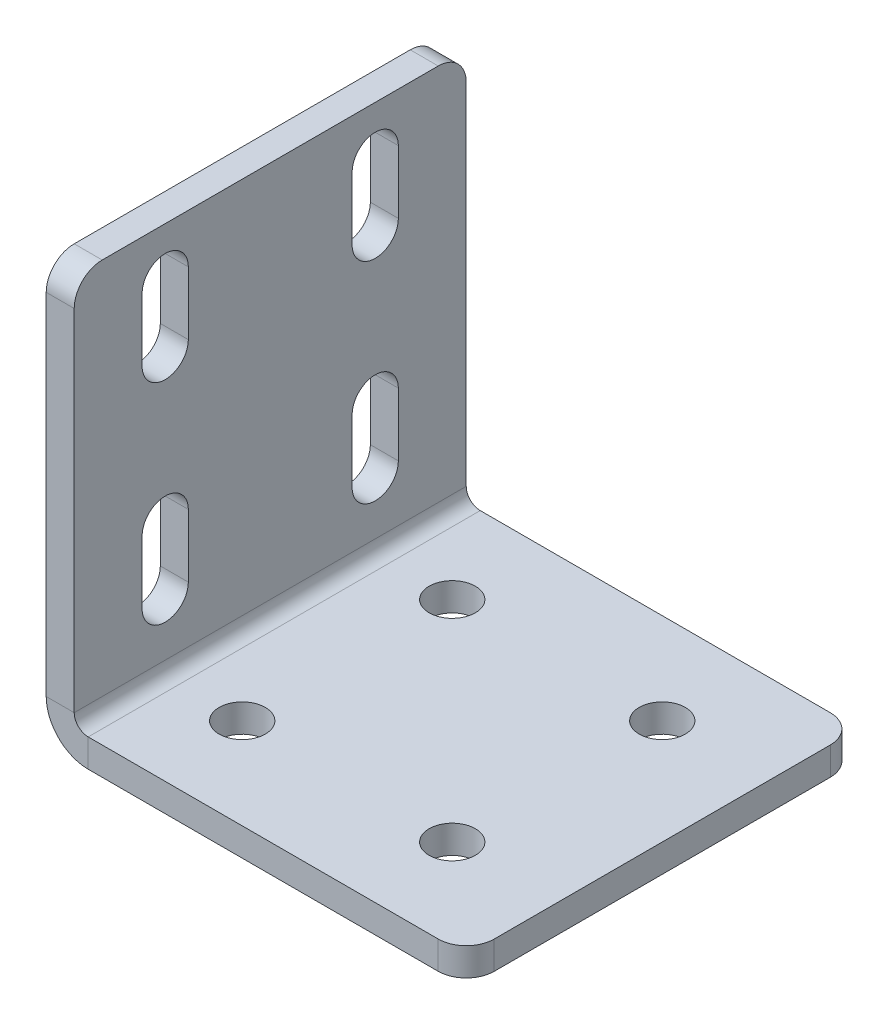
ISO-10303-21;
HEADER;
FILE_DESCRIPTION(('STEP AP214'),'2;1');
FILE_NAME('part.step','',(''),(''),'','','');
FILE_SCHEMA(('AUTOMOTIVE_DESIGN { 1 0 10303 214 1 1 1 1 }'));
ENDSEC;
DATA;
#1=APPLICATION_CONTEXT('core data for automotive mechanical design processes');
#2=APPLICATION_PROTOCOL_DEFINITION('international standard','automotive_design',2000,#1);
#3=PRODUCT_CONTEXT('',#1,'mechanical');
#4=PRODUCT('Part','Part','',(#3));
#5=PRODUCT_RELATED_PRODUCT_CATEGORY('part','',(#4));
#6=PRODUCT_DEFINITION_FORMATION('','',#4);
#7=PRODUCT_DEFINITION_CONTEXT('part definition',#1,'design');
#8=PRODUCT_DEFINITION('design','',#6,#7);
#9=PRODUCT_DEFINITION_SHAPE('','',#8);
#10=(LENGTH_UNIT() NAMED_UNIT(*) SI_UNIT(.MILLI.,.METRE.));
#11=(NAMED_UNIT(*) PLANE_ANGLE_UNIT() SI_UNIT($,.RADIAN.));
#12=(NAMED_UNIT(*) SI_UNIT($,.STERADIAN.) SOLID_ANGLE_UNIT());
#13=UNCERTAINTY_MEASURE_WITH_UNIT(LENGTH_MEASURE(1.E-05),#10,'distance_accuracy_value','');
#14=(GEOMETRIC_REPRESENTATION_CONTEXT(3) GLOBAL_UNCERTAINTY_ASSIGNED_CONTEXT((#13)) GLOBAL_UNIT_ASSIGNED_CONTEXT((#10,
#11,#12)) REPRESENTATION_CONTEXT('',''));
#15=CARTESIAN_POINT('',(0.,0.,0.));
#16=DIRECTION('',(0.,0.,1.));
#17=DIRECTION('',(1.,0.,0.));
#18=AXIS2_PLACEMENT_3D('',#15,#16,#17);
#19=CARTESIAN_POINT('',(0.,44.,-15.));
#20=DIRECTION('',(-1.,0.,0.));
#21=DIRECTION('',(0.,0.,1.));
#22=AXIS2_PLACEMENT_3D('',#19,#20,#21);
#23=CYLINDRICAL_SURFACE('',#22,3.3);
#24=CARTESIAN_POINT('',(4.,44.,-15.));
#25=DIRECTION('',(1.,0.,0.));
#26=DIRECTION('',(0.,0.,-1.));
#27=AXIS2_PLACEMENT_3D('',#24,#25,#26);
#28=CIRCLE('',#27,3.3);
#29=CARTESIAN_POINT('',(4.,44.,-11.7));
#30=VERTEX_POINT('',#29);
#31=CARTESIAN_POINT('',(4.,44.,-18.3));
#32=VERTEX_POINT('',#31);
#33=EDGE_CURVE('E497',#30,#32,#28,.T.);
#34=ORIENTED_EDGE('',*,*,#33,.T.);
#35=DIRECTION('',(1.,0.,0.));
#36=VECTOR('',#35,1.);
#37=CARTESIAN_POINT('',(0.,44.,-18.3));
#38=LINE('',#37,#36);
#39=CARTESIAN_POINT('',(0.,44.,-18.3));
#40=VERTEX_POINT('',#39);
#41=EDGE_CURVE('E308',#40,#32,#38,.T.);
#42=ORIENTED_EDGE('',*,*,#41,.F.);
#43=CARTESIAN_POINT('',(0.,44.,-15.));
#44=DIRECTION('',(1.,0.,0.));
#45=DIRECTION('',(0.,0.,-1.));
#46=AXIS2_PLACEMENT_3D('',#43,#44,#45);
#47=CIRCLE('',#46,3.3);
#48=CARTESIAN_POINT('',(0.,44.,-11.7));
#49=VERTEX_POINT('',#48);
#50=EDGE_CURVE('E386',#49,#40,#47,.T.);
#51=ORIENTED_EDGE('',*,*,#50,.F.);
#52=DIRECTION('',(1.,0.,0.));
#53=VECTOR('',#52,1.);
#54=CARTESIAN_POINT('',(0.,44.,-11.7));
#55=LINE('',#54,#53);
#56=EDGE_CURVE('E311',#49,#30,#55,.T.);
#57=ORIENTED_EDGE('',*,*,#56,.T.);
#58=EDGE_LOOP('',(#34,#42,#51,#57));
#59=FACE_BOUND('',#58,.T.);
#60=ADVANCED_FACE('F46',(#59),#23,.F.);
#61=CARTESIAN_POINT('',(0.,14.,15.));
#62=DIRECTION('',(-1.,0.,0.));
#63=DIRECTION('',(0.,0.,1.));
#64=AXIS2_PLACEMENT_3D('',#61,#62,#63);
#65=CYLINDRICAL_SURFACE('',#64,3.3);
#66=CARTESIAN_POINT('',(4.,14.,15.));
#67=DIRECTION('',(1.,0.,0.));
#68=DIRECTION('',(0.,0.,-1.));
#69=AXIS2_PLACEMENT_3D('',#66,#67,#68);
#70=CIRCLE('',#69,3.3);
#71=CARTESIAN_POINT('',(4.,14.,18.3));
#72=VERTEX_POINT('',#71);
#73=CARTESIAN_POINT('',(4.,14.,11.7));
#74=VERTEX_POINT('',#73);
#75=EDGE_CURVE('E514',#72,#74,#70,.T.);
#76=ORIENTED_EDGE('',*,*,#75,.T.);
#77=DIRECTION('',(1.,0.,0.));
#78=VECTOR('',#77,1.);
#79=CARTESIAN_POINT('',(0.,14.,11.7));
#80=LINE('',#79,#78);
#81=CARTESIAN_POINT('',(0.,14.,11.7));
#82=VERTEX_POINT('',#81);
#83=EDGE_CURVE('E376',#82,#74,#80,.T.);
#84=ORIENTED_EDGE('',*,*,#83,.F.);
#85=CARTESIAN_POINT('',(0.,14.,15.));
#86=DIRECTION('',(1.,0.,0.));
#87=DIRECTION('',(0.,0.,-1.));
#88=AXIS2_PLACEMENT_3D('',#85,#86,#87);
#89=CIRCLE('',#88,3.3);
#90=CARTESIAN_POINT('',(0.,14.,18.3));
#91=VERTEX_POINT('',#90);
#92=EDGE_CURVE('E390',#91,#82,#89,.T.);
#93=ORIENTED_EDGE('',*,*,#92,.F.);
#94=DIRECTION('',(1.,0.,0.));
#95=VECTOR('',#94,1.);
#96=CARTESIAN_POINT('',(0.,14.,18.3));
#97=LINE('',#96,#95);
#98=EDGE_CURVE('E379',#91,#72,#97,.T.);
#99=ORIENTED_EDGE('',*,*,#98,.T.);
#100=EDGE_LOOP('',(#76,#84,#93,#99));
#101=FACE_BOUND('',#100,.T.);
#102=ADVANCED_FACE('F661',(#101),#65,.F.);
#103=CARTESIAN_POINT('',(0.,44.,15.));
#104=DIRECTION('',(-1.,0.,0.));
#105=DIRECTION('',(0.,0.,1.));
#106=AXIS2_PLACEMENT_3D('',#103,#104,#105);
#107=CYLINDRICAL_SURFACE('',#106,3.3);
#108=CARTESIAN_POINT('',(4.,44.,15.));
#109=DIRECTION('',(1.,0.,0.));
#110=DIRECTION('',(0.,0.,-1.));
#111=AXIS2_PLACEMENT_3D('',#108,#109,#110);
#112=CIRCLE('',#111,3.3);
#113=CARTESIAN_POINT('',(4.,44.,18.3));
#114=VERTEX_POINT('',#113);
#115=CARTESIAN_POINT('',(4.,44.,11.7));
#116=VERTEX_POINT('',#115);
#117=EDGE_CURVE('E518',#114,#116,#112,.T.);
#118=ORIENTED_EDGE('',*,*,#117,.T.);
#119=DIRECTION('',(1.,0.,0.));
#120=VECTOR('',#119,1.);
#121=CARTESIAN_POINT('',(0.,44.,11.7));
#122=LINE('',#121,#120);
#123=CARTESIAN_POINT('',(0.,44.,11.7));
#124=VERTEX_POINT('',#123);
#125=EDGE_CURVE('E278',#124,#116,#122,.T.);
#126=ORIENTED_EDGE('',*,*,#125,.F.);
#127=CARTESIAN_POINT('',(0.,44.,15.));
#128=DIRECTION('',(1.,0.,0.));
#129=DIRECTION('',(0.,0.,-1.));
#130=AXIS2_PLACEMENT_3D('',#127,#128,#129);
#131=CIRCLE('',#130,3.3);
#132=CARTESIAN_POINT('',(0.,44.,18.3));
#133=VERTEX_POINT('',#132);
#134=EDGE_CURVE('E395',#133,#124,#131,.T.);
#135=ORIENTED_EDGE('',*,*,#134,.F.);
#136=DIRECTION('',(1.,0.,0.));
#137=VECTOR('',#136,1.);
#138=CARTESIAN_POINT('',(0.,44.,18.3));
#139=LINE('',#138,#137);
#140=EDGE_CURVE('E243',#133,#114,#139,.T.);
#141=ORIENTED_EDGE('',*,*,#140,.T.);
#142=EDGE_LOOP('',(#118,#126,#135,#141));
#143=FACE_BOUND('',#142,.T.);
#144=ADVANCED_FACE('F667',(#143),#107,.F.);
#145=CARTESIAN_POINT('',(0.,14.,-15.));
#146=DIRECTION('',(-1.,0.,0.));
#147=DIRECTION('',(0.,0.,1.));
#148=AXIS2_PLACEMENT_3D('',#145,#146,#147);
#149=CYLINDRICAL_SURFACE('',#148,3.3);
#150=CARTESIAN_POINT('',(4.,14.,-15.));
#151=DIRECTION('',(1.,0.,0.));
#152=DIRECTION('',(0.,0.,-1.));
#153=AXIS2_PLACEMENT_3D('',#150,#151,#152);
#154=CIRCLE('',#153,3.3);
#155=CARTESIAN_POINT('',(4.,14.,-11.7));
#156=VERTEX_POINT('',#155);
#157=CARTESIAN_POINT('',(4.,14.,-18.3));
#158=VERTEX_POINT('',#157);
#159=EDGE_CURVE('E507',#156,#158,#154,.T.);
#160=ORIENTED_EDGE('',*,*,#159,.T.);
#161=DIRECTION('',(1.,0.,0.));
#162=VECTOR('',#161,1.);
#163=CARTESIAN_POINT('',(0.,14.,-18.3));
#164=LINE('',#163,#162);
#165=CARTESIAN_POINT('',(0.,14.,-18.3));
#166=VERTEX_POINT('',#165);
#167=EDGE_CURVE('E341',#166,#158,#164,.T.);
#168=ORIENTED_EDGE('',*,*,#167,.F.);
#169=CARTESIAN_POINT('',(0.,14.,-15.));
#170=DIRECTION('',(1.,0.,0.));
#171=DIRECTION('',(0.,0.,-1.));
#172=AXIS2_PLACEMENT_3D('',#169,#170,#171);
#173=CIRCLE('',#172,3.3);
#174=CARTESIAN_POINT('',(0.,14.,-11.7));
#175=VERTEX_POINT('',#174);
#176=EDGE_CURVE('E398',#175,#166,#173,.T.);
#177=ORIENTED_EDGE('',*,*,#176,.F.);
#178=DIRECTION('',(1.,0.,0.));
#179=VECTOR('',#178,1.);
#180=CARTESIAN_POINT('',(0.,14.,-11.7));
#181=LINE('',#180,#179);
#182=EDGE_CURVE('E344',#175,#156,#181,.T.);
#183=ORIENTED_EDGE('',*,*,#182,.T.);
#184=EDGE_LOOP('',(#160,#168,#177,#183));
#185=FACE_BOUND('',#184,.T.);
#186=ADVANCED_FACE('F675',(#185),#149,.F.);
#187=CARTESIAN_POINT('',(0.,0.,28.));
#188=DIRECTION('',(0.,0.,-1.));
#189=DIRECTION('',(0.,-1.,0.));
#190=AXIS2_PLACEMENT_3D('',#187,#188,#189);
#191=PLANE('',#190);
#192=DIRECTION('',(0.,1.,0.));
#193=VECTOR('',#192,1.);
#194=CARTESIAN_POINT('',(4.,0.,28.));
#195=LINE('',#194,#193);
#196=CARTESIAN_POINT('',(4.,56.,28.));
#197=VERTEX_POINT('',#196);
#198=CARTESIAN_POINT('',(4.,6.,28.));
#199=VERTEX_POINT('',#198);
#200=EDGE_CURVE('E504',#197,#199,#195,.F.);
#201=ORIENTED_EDGE('',*,*,#200,.F.);
#202=DIRECTION('',(1.,0.,0.));
#203=VECTOR('',#202,1.);
#204=CARTESIAN_POINT('',(0.,56.,28.));
#205=LINE('',#204,#203);
#206=CARTESIAN_POINT('',(0.,56.,28.));
#207=VERTEX_POINT('',#206);
#208=EDGE_CURVE('E11',#197,#207,#205,.F.);
#209=ORIENTED_EDGE('',*,*,#208,.T.);
#210=DIRECTION('',(0.,-1.,0.));
#211=VECTOR('',#210,1.);
#212=CARTESIAN_POINT('',(0.,0.,28.));
#213=LINE('',#212,#211);
#214=CARTESIAN_POINT('',(0.,6.,28.));
#215=VERTEX_POINT('',#214);
#216=EDGE_CURVE('E402',#207,#215,#213,.T.);
#217=ORIENTED_EDGE('',*,*,#216,.T.);
#218=DIRECTION('',(-1.,0.,0.));
#219=VECTOR('',#218,1.);
#220=CARTESIAN_POINT('',(0.,6.,28.));
#221=LINE('',#220,#219);
#222=EDGE_CURVE('E532',#199,#215,#221,.T.);
#223=ORIENTED_EDGE('',*,*,#222,.F.);
#224=EDGE_LOOP('',(#201,#209,#217,#223));
#225=FACE_BOUND('',#224,.T.);
#226=ADVANCED_FACE('F618',(#225),#191,.F.);
#227=CARTESIAN_POINT('',(0.,60.,-28.));
#228=DIRECTION('',(0.,-1.,0.));
#229=DIRECTION('',(0.,0.,1.));
#230=AXIS2_PLACEMENT_3D('',#227,#228,#229);
#231=PLANE('',#230);
#232=DIRECTION('',(0.,0.,1.));
#233=VECTOR('',#232,1.);
#234=CARTESIAN_POINT('',(4.,60.,-28.));
#235=LINE('',#234,#233);
#236=CARTESIAN_POINT('',(4.,60.,-24.));
#237=VERTEX_POINT('',#236);
#238=CARTESIAN_POINT('',(4.,60.,24.));
#239=VERTEX_POINT('',#238);
#240=EDGE_CURVE('E500',#237,#239,#235,.T.);
#241=ORIENTED_EDGE('',*,*,#240,.F.);
#242=DIRECTION('',(-1.,0.,0.));
#243=VECTOR('',#242,1.);
#244=CARTESIAN_POINT('',(0.,60.,-24.));
#245=LINE('',#244,#243);
#246=CARTESIAN_POINT('',(0.,60.,-24.));
#247=VERTEX_POINT('',#246);
#248=EDGE_CURVE('E567',#237,#247,#245,.T.);
#249=ORIENTED_EDGE('',*,*,#248,.T.);
#250=DIRECTION('',(0.,0.,1.));
#251=VECTOR('',#250,1.);
#252=CARTESIAN_POINT('',(0.,60.,-28.));
#253=LINE('',#252,#251);
#254=CARTESIAN_POINT('',(0.,60.,24.));
#255=VERTEX_POINT('',#254);
#256=EDGE_CURVE('E405',#247,#255,#253,.T.);
#257=ORIENTED_EDGE('',*,*,#256,.T.);
#258=DIRECTION('',(1.,0.,0.));
#259=VECTOR('',#258,1.);
#260=CARTESIAN_POINT('',(0.,60.,24.));
#261=LINE('',#260,#259);
#262=EDGE_CURVE('E564',#255,#239,#261,.T.);
#263=ORIENTED_EDGE('',*,*,#262,.T.);
#264=EDGE_LOOP('',(#241,#249,#257,#263));
#265=FACE_BOUND('',#264,.T.);
#266=ADVANCED_FACE('F596',(#265),#231,.F.);
#267=CARTESIAN_POINT('',(0.,0.,-28.));
#268=DIRECTION('',(0.,0.,-1.));
#269=DIRECTION('',(0.,-1.,0.));
#270=AXIS2_PLACEMENT_3D('',#267,#268,#269);
#271=PLANE('',#270);
#272=DIRECTION('',(0.,-1.,0.));
#273=VECTOR('',#272,1.);
#274=CARTESIAN_POINT('',(0.,0.,-28.));
#275=LINE('',#274,#273);
#276=CARTESIAN_POINT('',(0.,56.,-28.));
#277=VERTEX_POINT('',#276);
#278=CARTESIAN_POINT('',(0.,6.,-28.));
#279=VERTEX_POINT('',#278);
#280=EDGE_CURVE('E409',#277,#279,#275,.T.);
#281=ORIENTED_EDGE('',*,*,#280,.F.);
#282=DIRECTION('',(1.,0.,0.));
#283=VECTOR('',#282,1.);
#284=CARTESIAN_POINT('',(0.,56.,-28.));
#285=LINE('',#284,#283);
#286=CARTESIAN_POINT('',(4.,56.,-28.));
#287=VERTEX_POINT('',#286);
#288=EDGE_CURVE('E577',#277,#287,#285,.T.);
#289=ORIENTED_EDGE('',*,*,#288,.T.);
#290=DIRECTION('',(0.,1.,0.));
#291=VECTOR('',#290,1.);
#292=CARTESIAN_POINT('',(4.,0.,-28.));
#293=LINE('',#292,#291);
#294=CARTESIAN_POINT('',(4.,6.,-28.));
#295=VERTEX_POINT('',#294);
#296=EDGE_CURVE('E470',#287,#295,#293,.F.);
#297=ORIENTED_EDGE('',*,*,#296,.T.);
#298=DIRECTION('',(-1.,0.,0.));
#299=VECTOR('',#298,1.);
#300=CARTESIAN_POINT('',(0.,6.,-28.));
#301=LINE('',#300,#299);
#302=EDGE_CURVE('E528',#295,#279,#301,.T.);
#303=ORIENTED_EDGE('',*,*,#302,.T.);
#304=EDGE_LOOP('',(#281,#289,#297,#303));
#305=FACE_BOUND('',#304,.T.);
#306=ADVANCED_FACE('F603',(#305),#271,.T.);
#307=CARTESIAN_POINT('',(6.,6.,-28.));
#308=DIRECTION('',(0.,0.,1.));
#309=DIRECTION('',(1.,0.,0.));
#310=AXIS2_PLACEMENT_3D('',#307,#308,#309);
#311=PLANE('',#310);
#312=ORIENTED_EDGE('',*,*,#302,.F.);
#313=CARTESIAN_POINT('',(6.,6.,-28.));
#314=DIRECTION('',(0.,0.,1.));
#315=DIRECTION('',(1.,0.,0.));
#316=AXIS2_PLACEMENT_3D('',#313,#314,#315);
#317=CIRCLE('',#316,2.);
#318=CARTESIAN_POINT('',(6.,4.,-28.));
#319=VERTEX_POINT('',#318);
#320=EDGE_CURVE('E493',#295,#319,#317,.T.);
#321=ORIENTED_EDGE('',*,*,#320,.T.);
#322=DIRECTION('',(0.,-1.,0.));
#323=VECTOR('',#322,1.);
#324=CARTESIAN_POINT('',(6.,0.,-28.));
#325=LINE('',#324,#323);
#326=CARTESIAN_POINT('',(6.,0.,-28.));
#327=VERTEX_POINT('',#326);
#328=EDGE_CURVE('E525',#319,#327,#325,.T.);
#329=ORIENTED_EDGE('',*,*,#328,.T.);
#330=CARTESIAN_POINT('',(6.,6.,-28.));
#331=DIRECTION('',(0.,0.,-1.));
#332=DIRECTION('',(-1.,0.,0.));
#333=AXIS2_PLACEMENT_3D('',#330,#331,#332);
#334=CIRCLE('',#333,6.);
#335=EDGE_CURVE('E391',#279,#327,#334,.F.);
#336=ORIENTED_EDGE('',*,*,#335,.F.);
#337=EDGE_LOOP('',(#312,#321,#329,#336));
#338=FACE_BOUND('',#337,.T.);
#339=ADVANCED_FACE('F608',(#338),#311,.F.);
#340=CARTESIAN_POINT('',(60.,0.,-28.));
#341=DIRECTION('',(0.,0.,-1.));
#342=DIRECTION('',(1.,0.,0.));
#343=AXIS2_PLACEMENT_3D('',#340,#341,#342);
#344=PLANE('',#343);
#345=DIRECTION('',(1.,0.,0.));
#346=VECTOR('',#345,1.);
#347=CARTESIAN_POINT('',(60.,4.,-28.));
#348=LINE('',#347,#346);
#349=CARTESIAN_POINT('',(56.,4.,-28.));
#350=VERTEX_POINT('',#349);
#351=EDGE_CURVE('E464',#319,#350,#348,.T.);
#352=ORIENTED_EDGE('',*,*,#351,.T.);
#353=DIRECTION('',(0.,-1.,0.));
#354=VECTOR('',#353,1.);
#355=CARTESIAN_POINT('',(56.,0.,-28.));
#356=LINE('',#355,#354);
#357=CARTESIAN_POINT('',(56.,0.,-28.));
#358=VERTEX_POINT('',#357);
#359=EDGE_CURVE('E536',#350,#358,#356,.T.);
#360=ORIENTED_EDGE('',*,*,#359,.T.);
#361=DIRECTION('',(1.,0.,0.));
#362=VECTOR('',#361,1.);
#363=CARTESIAN_POINT('',(60.,0.,-28.));
#364=LINE('',#363,#362);
#365=EDGE_CURVE('E436',#327,#358,#364,.T.);
#366=ORIENTED_EDGE('',*,*,#365,.F.);
#367=ORIENTED_EDGE('',*,*,#328,.F.);
#368=EDGE_LOOP('',(#352,#360,#366,#367));
#369=FACE_BOUND('',#368,.T.);
#370=ADVANCED_FACE('F651',(#369),#344,.T.);
#371=CARTESIAN_POINT('',(60.,0.,-28.));
#372=DIRECTION('',(1.,0.,0.));
#373=DIRECTION('',(0.,0.,1.));
#374=AXIS2_PLACEMENT_3D('',#371,#372,#373);
#375=PLANE('',#374);
#376=DIRECTION('',(0.,0.,1.));
#377=VECTOR('',#376,1.);
#378=CARTESIAN_POINT('',(60.,0.,-28.));
#379=LINE('',#378,#377);
#380=CARTESIAN_POINT('',(60.,0.,-24.));
#381=VERTEX_POINT('',#380);
#382=CARTESIAN_POINT('',(60.,0.,24.));
#383=VERTEX_POINT('',#382);
#384=EDGE_CURVE('E428',#381,#383,#379,.T.);
#385=ORIENTED_EDGE('',*,*,#384,.F.);
#386=DIRECTION('',(0.,-1.,0.));
#387=VECTOR('',#386,1.);
#388=CARTESIAN_POINT('',(60.,0.,-24.));
#389=LINE('',#388,#387);
#390=CARTESIAN_POINT('',(60.,4.,-24.));
#391=VERTEX_POINT('',#390);
#392=EDGE_CURVE('E552',#381,#391,#389,.F.);
#393=ORIENTED_EDGE('',*,*,#392,.T.);
#394=DIRECTION('',(0.,0.,1.));
#395=VECTOR('',#394,1.);
#396=CARTESIAN_POINT('',(60.,4.,-28.));
#397=LINE('',#396,#395);
#398=CARTESIAN_POINT('',(60.,4.,24.));
#399=VERTEX_POINT('',#398);
#400=EDGE_CURVE('E482',#391,#399,#397,.T.);
#401=ORIENTED_EDGE('',*,*,#400,.T.);
#402=DIRECTION('',(0.,1.,0.));
#403=VECTOR('',#402,1.);
#404=CARTESIAN_POINT('',(60.,0.,24.));
#405=LINE('',#404,#403);
#406=EDGE_CURVE('E548',#399,#383,#405,.F.);
#407=ORIENTED_EDGE('',*,*,#406,.T.);
#408=EDGE_LOOP('',(#385,#393,#401,#407));
#409=FACE_BOUND('',#408,.T.);
#410=ADVANCED_FACE('F642',(#409),#375,.T.);
#411=CARTESIAN_POINT('',(60.,0.,28.));
#412=DIRECTION('',(0.,0.,-1.));
#413=DIRECTION('',(1.,0.,0.));
#414=AXIS2_PLACEMENT_3D('',#411,#412,#413);
#415=PLANE('',#414);
#416=DIRECTION('',(1.,0.,0.));
#417=VECTOR('',#416,1.);
#418=CARTESIAN_POINT('',(60.,0.,28.));
#419=LINE('',#418,#417);
#420=CARTESIAN_POINT('',(6.,0.,28.));
#421=VERTEX_POINT('',#420);
#422=CARTESIAN_POINT('',(56.,0.,28.));
#423=VERTEX_POINT('',#422);
#424=EDGE_CURVE('E432',#421,#423,#419,.T.);
#425=ORIENTED_EDGE('',*,*,#424,.T.);
#426=DIRECTION('',(0.,-1.,0.));
#427=VECTOR('',#426,1.);
#428=CARTESIAN_POINT('',(56.,0.,28.));
#429=LINE('',#428,#427);
#430=CARTESIAN_POINT('',(56.,4.,28.));
#431=VERTEX_POINT('',#430);
#432=EDGE_CURVE('E561',#423,#431,#429,.F.);
#433=ORIENTED_EDGE('',*,*,#432,.T.);
#434=DIRECTION('',(1.,0.,0.));
#435=VECTOR('',#434,1.);
#436=CARTESIAN_POINT('',(60.,4.,28.));
#437=LINE('',#436,#435);
#438=CARTESIAN_POINT('',(6.,4.,28.));
#439=VERTEX_POINT('',#438);
#440=EDGE_CURVE('E483',#439,#431,#437,.T.);
#441=ORIENTED_EDGE('',*,*,#440,.F.);
#442=DIRECTION('',(0.,-1.,0.));
#443=VECTOR('',#442,1.);
#444=CARTESIAN_POINT('',(6.,0.,28.));
#445=LINE('',#444,#443);
#446=EDGE_CURVE('E448',#439,#421,#445,.T.);
#447=ORIENTED_EDGE('',*,*,#446,.T.);
#448=EDGE_LOOP('',(#425,#433,#441,#447));
#449=FACE_BOUND('',#448,.T.);
#450=ADVANCED_FACE('F629',(#449),#415,.F.);
#451=CARTESIAN_POINT('',(15.,0.,-15.));
#452=DIRECTION('',(0.,-1.,0.));
#453=DIRECTION('',(1.,0.,0.));
#454=AXIS2_PLACEMENT_3D('',#451,#452,#453);
#455=CYLINDRICAL_SURFACE('',#454,3.29999999999999);
#456=CARTESIAN_POINT('',(15.,0.,-15.));
#457=DIRECTION('',(0.,-1.,0.));
#458=DIRECTION('',(0.,0.,-1.));
#459=AXIS2_PLACEMENT_3D('',#456,#457,#458);
#460=CIRCLE('',#459,3.29999999999999);
#461=CARTESIAN_POINT('',(15.,0.,-18.3));
#462=VERTEX_POINT('',#461);
#463=EDGE_CURVE('E412',#462,#462,#460,.T.);
#464=ORIENTED_EDGE('',*,*,#463,.T.);
#465=EDGE_LOOP('',(#464));
#466=FACE_BOUND('',#465,.T.);
#467=CARTESIAN_POINT('',(15.,4.,-15.));
#468=DIRECTION('',(0.,-1.,0.));
#469=DIRECTION('',(0.,0.,-1.));
#470=AXIS2_PLACEMENT_3D('',#467,#468,#469);
#471=CIRCLE('',#470,3.29999999999999);
#472=CARTESIAN_POINT('',(15.,4.,-18.3));
#473=VERTEX_POINT('',#472);
#474=EDGE_CURVE('E465',#473,#473,#471,.T.);
#475=ORIENTED_EDGE('',*,*,#474,.F.);
#476=EDGE_LOOP('',(#475));
#477=FACE_BOUND('',#476,.T.);
#478=ADVANCED_FACE('F719',(#466,#477),#455,.F.);
#479=CARTESIAN_POINT('',(45.,0.,15.));
#480=DIRECTION('',(0.,-1.,0.));
#481=DIRECTION('',(1.,0.,0.));
#482=AXIS2_PLACEMENT_3D('',#479,#480,#481);
#483=CYLINDRICAL_SURFACE('',#482,3.29999999999999);
#484=CARTESIAN_POINT('',(45.,0.,15.));
#485=DIRECTION('',(0.,-1.,0.));
#486=DIRECTION('',(0.,0.,-1.));
#487=AXIS2_PLACEMENT_3D('',#484,#485,#486);
#488=CIRCLE('',#487,3.29999999999999);
#489=CARTESIAN_POINT('',(45.,0.,11.7));
#490=VERTEX_POINT('',#489);
#491=EDGE_CURVE('E416',#490,#490,#488,.T.);
#492=ORIENTED_EDGE('',*,*,#491,.T.);
#493=EDGE_LOOP('',(#492));
#494=FACE_BOUND('',#493,.T.);
#495=CARTESIAN_POINT('',(45.,4.,15.));
#496=DIRECTION('',(0.,-1.,0.));
#497=DIRECTION('',(0.,0.,-1.));
#498=AXIS2_PLACEMENT_3D('',#495,#496,#497);
#499=CIRCLE('',#498,3.29999999999999);
#500=CARTESIAN_POINT('',(45.,4.,11.7));
#501=VERTEX_POINT('',#500);
#502=EDGE_CURVE('E469',#501,#501,#499,.T.);
#503=ORIENTED_EDGE('',*,*,#502,.F.);
#504=EDGE_LOOP('',(#503));
#505=FACE_BOUND('',#504,.T.);
#506=ADVANCED_FACE('F722',(#494,#505),#483,.F.);
#507=CARTESIAN_POINT('',(45.,0.,-15.));
#508=DIRECTION('',(0.,-1.,0.));
#509=DIRECTION('',(1.,0.,0.));
#510=AXIS2_PLACEMENT_3D('',#507,#508,#509);
#511=CYLINDRICAL_SURFACE('',#510,3.29999999999999);
#512=CARTESIAN_POINT('',(45.,0.,-15.));
#513=DIRECTION('',(0.,-1.,0.));
#514=DIRECTION('',(0.,0.,-1.));
#515=AXIS2_PLACEMENT_3D('',#512,#513,#514);
#516=CIRCLE('',#515,3.29999999999999);
#517=CARTESIAN_POINT('',(45.,0.,-18.3));
#518=VERTEX_POINT('',#517);
#519=EDGE_CURVE('E420',#518,#518,#516,.T.);
#520=ORIENTED_EDGE('',*,*,#519,.T.);
#521=EDGE_LOOP('',(#520));
#522=FACE_BOUND('',#521,.T.);
#523=CARTESIAN_POINT('',(45.,4.,-15.));
#524=DIRECTION('',(0.,-1.,0.));
#525=DIRECTION('',(0.,0.,-1.));
#526=AXIS2_PLACEMENT_3D('',#523,#524,#525);
#527=CIRCLE('',#526,3.29999999999999);
#528=CARTESIAN_POINT('',(45.,4.,-18.3));
#529=VERTEX_POINT('',#528);
#530=EDGE_CURVE('E474',#529,#529,#527,.T.);
#531=ORIENTED_EDGE('',*,*,#530,.F.);
#532=EDGE_LOOP('',(#531));
#533=FACE_BOUND('',#532,.T.);
#534=ADVANCED_FACE('F726',(#522,#533),#511,.F.);
#535=CARTESIAN_POINT('',(15.,0.,15.));
#536=DIRECTION('',(0.,-1.,0.));
#537=DIRECTION('',(1.,0.,0.));
#538=AXIS2_PLACEMENT_3D('',#535,#536,#537);
#539=CYLINDRICAL_SURFACE('',#538,3.29999999999999);
#540=CARTESIAN_POINT('',(15.,0.,15.));
#541=DIRECTION('',(0.,-1.,0.));
#542=DIRECTION('',(0.,0.,-1.));
#543=AXIS2_PLACEMENT_3D('',#540,#541,#542);
#544=CIRCLE('',#543,3.29999999999999);
#545=CARTESIAN_POINT('',(15.,0.,11.7));
#546=VERTEX_POINT('',#545);
#547=EDGE_CURVE('E424',#546,#546,#544,.T.);
#548=ORIENTED_EDGE('',*,*,#547,.T.);
#549=EDGE_LOOP('',(#548));
#550=FACE_BOUND('',#549,.T.);
#551=CARTESIAN_POINT('',(15.,4.,15.));
#552=DIRECTION('',(0.,-1.,0.));
#553=DIRECTION('',(0.,0.,-1.));
#554=AXIS2_PLACEMENT_3D('',#551,#552,#553);
#555=CIRCLE('',#554,3.29999999999999);
#556=CARTESIAN_POINT('',(15.,4.,11.7));
#557=VERTEX_POINT('',#556);
#558=EDGE_CURVE('E478',#557,#557,#555,.T.);
#559=ORIENTED_EDGE('',*,*,#558,.F.);
#560=EDGE_LOOP('',(#559));
#561=FACE_BOUND('',#560,.T.);
#562=ADVANCED_FACE('F730',(#550,#561),#539,.F.);
#563=CARTESIAN_POINT('',(6.,6.,28.));
#564=DIRECTION('',(0.,0.,-1.));
#565=DIRECTION('',(-1.,0.,0.));
#566=AXIS2_PLACEMENT_3D('',#563,#564,#565);
#567=PLANE('',#566);
#568=CARTESIAN_POINT('',(6.,6.,28.));
#569=DIRECTION('',(0.,0.,1.));
#570=DIRECTION('',(1.,0.,0.));
#571=AXIS2_PLACEMENT_3D('',#568,#569,#570);
#572=CIRCLE('',#571,2.);
#573=EDGE_CURVE('E375',#439,#199,#572,.F.);
#574=ORIENTED_EDGE('',*,*,#573,.T.);
#575=ORIENTED_EDGE('',*,*,#222,.T.);
#576=CARTESIAN_POINT('',(6.,6.,28.));
#577=DIRECTION('',(0.,0.,1.));
#578=DIRECTION('',(1.,0.,0.));
#579=AXIS2_PLACEMENT_3D('',#576,#577,#578);
#580=CIRCLE('',#579,6.);
#581=EDGE_CURVE('E449',#421,#215,#580,.F.);
#582=ORIENTED_EDGE('',*,*,#581,.F.);
#583=ORIENTED_EDGE('',*,*,#446,.F.);
#584=EDGE_LOOP('',(#574,#575,#582,#583));
#585=FACE_BOUND('',#584,.T.);
#586=ADVANCED_FACE('F621',(#585),#567,.F.);
#587=CARTESIAN_POINT('',(60.,0.,-28.));
#588=DIRECTION('',(0.,-1.,0.));
#589=DIRECTION('',(1.,0.,0.));
#590=AXIS2_PLACEMENT_3D('',#587,#588,#589);
#591=PLANE('',#590);
#592=ORIENTED_EDGE('',*,*,#463,.F.);
#593=EDGE_LOOP('',(#592));
#594=FACE_BOUND('',#593,.T.);
#595=ORIENTED_EDGE('',*,*,#491,.F.);
#596=EDGE_LOOP('',(#595));
#597=FACE_BOUND('',#596,.T.);
#598=ORIENTED_EDGE('',*,*,#519,.F.);
#599=EDGE_LOOP('',(#598));
#600=FACE_BOUND('',#599,.T.);
#601=ORIENTED_EDGE('',*,*,#547,.F.);
#602=EDGE_LOOP('',(#601));
#603=FACE_BOUND('',#602,.T.);
#604=ORIENTED_EDGE('',*,*,#365,.T.);
#605=CARTESIAN_POINT('',(56.,0.,-24.));
#606=DIRECTION('',(0.,-1.,0.));
#607=DIRECTION('',(1.,0.,0.));
#608=AXIS2_PLACEMENT_3D('',#605,#606,#607);
#609=CIRCLE('',#608,4.);
#610=EDGE_CURVE('E545',#358,#381,#609,.T.);
#611=ORIENTED_EDGE('',*,*,#610,.T.);
#612=ORIENTED_EDGE('',*,*,#384,.T.);
#613=CARTESIAN_POINT('',(56.,0.,24.));
#614=DIRECTION('',(0.,-1.,0.));
#615=DIRECTION('',(1.,0.,0.));
#616=AXIS2_PLACEMENT_3D('',#613,#614,#615);
#617=CIRCLE('',#616,4.);
#618=EDGE_CURVE('E542',#383,#423,#617,.T.);
#619=ORIENTED_EDGE('',*,*,#618,.T.);
#620=ORIENTED_EDGE('',*,*,#424,.F.);
#621=DIRECTION('',(0.,0.,1.));
#622=VECTOR('',#621,1.);
#623=CARTESIAN_POINT('',(6.,0.,-28.));
#624=LINE('',#623,#622);
#625=EDGE_CURVE('E444',#421,#327,#624,.F.);
#626=ORIENTED_EDGE('',*,*,#625,.T.);
#627=EDGE_LOOP('',(#604,#611,#612,#619,#620,#626));
#628=FACE_BOUND('',#627,.T.);
#629=ADVANCED_FACE('F645',(#594,#597,#600,#603,#628),#591,.T.);
#630=CARTESIAN_POINT('',(0.,0.,-28.));
#631=DIRECTION('',(-1.,0.,0.));
#632=DIRECTION('',(0.,0.,1.));
#633=AXIS2_PLACEMENT_3D('',#630,#631,#632);
#634=PLANE('',#633);
#635=DIRECTION('',(0.,1.,0.));
#636=VECTOR('',#635,1.);
#637=CARTESIAN_POINT('',(0.,23.,-18.3));
#638=LINE('',#637,#636);
#639=CARTESIAN_POINT('',(0.,23.,-18.3));
#640=VERTEX_POINT('',#639);
#641=EDGE_CURVE('E326',#166,#640,#638,.T.);
#642=ORIENTED_EDGE('',*,*,#641,.T.);
#643=CARTESIAN_POINT('',(0.,23.,-15.));
#644=DIRECTION('',(1.,0.,0.));
#645=DIRECTION('',(0.,0.,-1.));
#646=AXIS2_PLACEMENT_3D('',#643,#644,#645);
#647=CIRCLE('',#646,3.3);
#648=CARTESIAN_POINT('',(0.,23.,-11.7));
#649=VERTEX_POINT('',#648);
#650=EDGE_CURVE('E317',#640,#649,#647,.T.);
#651=ORIENTED_EDGE('',*,*,#650,.T.);
#652=DIRECTION('',(0.,-1.,0.));
#653=VECTOR('',#652,1.);
#654=CARTESIAN_POINT('',(0.,23.,-11.7));
#655=LINE('',#654,#653);
#656=EDGE_CURVE('E321',#649,#175,#655,.T.);
#657=ORIENTED_EDGE('',*,*,#656,.T.);
#658=ORIENTED_EDGE('',*,*,#176,.T.);
#659=EDGE_LOOP('',(#642,#651,#657,#658));
#660=FACE_BOUND('',#659,.T.);
#661=DIRECTION('',(0.,1.,0.));
#662=VECTOR('',#661,1.);
#663=CARTESIAN_POINT('',(0.,53.,-18.3));
#664=LINE('',#663,#662);
#665=CARTESIAN_POINT('',(0.,53.,-18.3));
#666=VERTEX_POINT('',#665);
#667=EDGE_CURVE('E292',#40,#666,#664,.T.);
#668=ORIENTED_EDGE('',*,*,#667,.T.);
#669=CARTESIAN_POINT('',(0.,53.,-15.));
#670=DIRECTION('',(1.,0.,0.));
#671=DIRECTION('',(0.,0.,-1.));
#672=AXIS2_PLACEMENT_3D('',#669,#670,#671);
#673=CIRCLE('',#672,3.3);
#674=CARTESIAN_POINT('',(0.,53.,-11.7));
#675=VERTEX_POINT('',#674);
#676=EDGE_CURVE('E283',#666,#675,#673,.T.);
#677=ORIENTED_EDGE('',*,*,#676,.T.);
#678=DIRECTION('',(0.,-1.,0.));
#679=VECTOR('',#678,1.);
#680=CARTESIAN_POINT('',(0.,53.,-11.7));
#681=LINE('',#680,#679);
#682=EDGE_CURVE('E287',#675,#49,#681,.T.);
#683=ORIENTED_EDGE('',*,*,#682,.T.);
#684=ORIENTED_EDGE('',*,*,#50,.T.);
#685=EDGE_LOOP('',(#668,#677,#683,#684));
#686=FACE_BOUND('',#685,.T.);
#687=DIRECTION('',(0.,1.,0.));
#688=VECTOR('',#687,1.);
#689=CARTESIAN_POINT('',(0.,53.,11.7));
#690=LINE('',#689,#688);
#691=CARTESIAN_POINT('',(0.,53.,11.7));
#692=VERTEX_POINT('',#691);
#693=EDGE_CURVE('E244',#124,#692,#690,.T.);
#694=ORIENTED_EDGE('',*,*,#693,.T.);
#695=CARTESIAN_POINT('',(0.,53.,15.));
#696=DIRECTION('',(1.,0.,0.));
#697=DIRECTION('',(0.,0.,-1.));
#698=AXIS2_PLACEMENT_3D('',#695,#696,#697);
#699=CIRCLE('',#698,3.3);
#700=CARTESIAN_POINT('',(0.,53.,18.3));
#701=VERTEX_POINT('',#700);
#702=EDGE_CURVE('E236',#692,#701,#699,.T.);
#703=ORIENTED_EDGE('',*,*,#702,.T.);
#704=DIRECTION('',(0.,-1.,0.));
#705=VECTOR('',#704,1.);
#706=CARTESIAN_POINT('',(0.,53.,18.3));
#707=LINE('',#706,#705);
#708=EDGE_CURVE('E247',#701,#133,#707,.T.);
#709=ORIENTED_EDGE('',*,*,#708,.T.);
#710=ORIENTED_EDGE('',*,*,#134,.T.);
#711=EDGE_LOOP('',(#694,#703,#709,#710));
#712=FACE_BOUND('',#711,.T.);
#713=DIRECTION('',(0.,1.,0.));
#714=VECTOR('',#713,1.);
#715=CARTESIAN_POINT('',(0.,23.,11.7));
#716=LINE('',#715,#714);
#717=CARTESIAN_POINT('',(0.,23.,11.7));
#718=VERTEX_POINT('',#717);
#719=EDGE_CURVE('E359',#82,#718,#716,.T.);
#720=ORIENTED_EDGE('',*,*,#719,.T.);
#721=CARTESIAN_POINT('',(0.,23.,15.));
#722=DIRECTION('',(1.,0.,0.));
#723=DIRECTION('',(0.,0.,-1.));
#724=AXIS2_PLACEMENT_3D('',#721,#722,#723);
#725=CIRCLE('',#724,3.3);
#726=CARTESIAN_POINT('',(0.,23.,18.3));
#727=VERTEX_POINT('',#726);
#728=EDGE_CURVE('E350',#718,#727,#725,.T.);
#729=ORIENTED_EDGE('',*,*,#728,.T.);
#730=DIRECTION('',(0.,-1.,0.));
#731=VECTOR('',#730,1.);
#732=CARTESIAN_POINT('',(0.,23.,18.3));
#733=LINE('',#732,#731);
#734=EDGE_CURVE('E354',#727,#91,#733,.T.);
#735=ORIENTED_EDGE('',*,*,#734,.T.);
#736=ORIENTED_EDGE('',*,*,#92,.T.);
#737=EDGE_LOOP('',(#720,#729,#735,#736));
#738=FACE_BOUND('',#737,.T.);
#739=ORIENTED_EDGE('',*,*,#256,.F.);
#740=CARTESIAN_POINT('',(0.,56.,-24.));
#741=DIRECTION('',(-1.,0.,0.));
#742=DIRECTION('',(0.,0.,1.));
#743=AXIS2_PLACEMENT_3D('',#740,#741,#742);
#744=CIRCLE('',#743,4.);
#745=EDGE_CURVE('E574',#247,#277,#744,.T.);
#746=ORIENTED_EDGE('',*,*,#745,.T.);
#747=ORIENTED_EDGE('',*,*,#280,.T.);
#748=DIRECTION('',(0.,0.,1.));
#749=VECTOR('',#748,1.);
#750=CARTESIAN_POINT('',(0.,6.,-28.));
#751=LINE('',#750,#749);
#752=EDGE_CURVE('E440',#279,#215,#751,.T.);
#753=ORIENTED_EDGE('',*,*,#752,.T.);
#754=ORIENTED_EDGE('',*,*,#216,.F.);
#755=CARTESIAN_POINT('',(0.,56.,24.));
#756=DIRECTION('',(-1.,0.,0.));
#757=DIRECTION('',(0.,0.,1.));
#758=AXIS2_PLACEMENT_3D('',#755,#756,#757);
#759=CIRCLE('',#758,4.);
#760=EDGE_CURVE('E571',#207,#255,#759,.T.);
#761=ORIENTED_EDGE('',*,*,#760,.T.);
#762=EDGE_LOOP('',(#739,#746,#747,#753,#754,#761));
#763=FACE_BOUND('',#762,.T.);
#764=ADVANCED_FACE('F255',(#660,#686,#712,#738,#763),#634,.T.);
#765=CARTESIAN_POINT('',(6.,6.,-28.));
#766=DIRECTION('',(0.,0.,1.));
#767=DIRECTION('',(1.,0.,0.));
#768=AXIS2_PLACEMENT_3D('',#765,#766,#767);
#769=CYLINDRICAL_SURFACE('',#768,6.);
#770=ORIENTED_EDGE('',*,*,#335,.T.);
#771=ORIENTED_EDGE('',*,*,#625,.F.);
#772=ORIENTED_EDGE('',*,*,#581,.T.);
#773=ORIENTED_EDGE('',*,*,#752,.F.);
#774=EDGE_LOOP('',(#770,#771,#772,#773));
#775=FACE_BOUND('',#774,.T.);
#776=ADVANCED_FACE('F612',(#775),#769,.T.);
#777=CARTESIAN_POINT('',(60.,4.,-28.));
#778=DIRECTION('',(0.,-1.,0.));
#779=DIRECTION('',(1.,0.,0.));
#780=AXIS2_PLACEMENT_3D('',#777,#778,#779);
#781=PLANE('',#780);
#782=ORIENTED_EDGE('',*,*,#474,.T.);
#783=EDGE_LOOP('',(#782));
#784=FACE_BOUND('',#783,.T.);
#785=ORIENTED_EDGE('',*,*,#502,.T.);
#786=EDGE_LOOP('',(#785));
#787=FACE_BOUND('',#786,.T.);
#788=ORIENTED_EDGE('',*,*,#530,.T.);
#789=EDGE_LOOP('',(#788));
#790=FACE_BOUND('',#789,.T.);
#791=ORIENTED_EDGE('',*,*,#558,.T.);
#792=EDGE_LOOP('',(#791));
#793=FACE_BOUND('',#792,.T.);
#794=ORIENTED_EDGE('',*,*,#400,.F.);
#795=CARTESIAN_POINT('',(56.,4.,-24.));
#796=DIRECTION('',(0.,-1.,0.));
#797=DIRECTION('',(1.,0.,0.));
#798=AXIS2_PLACEMENT_3D('',#795,#796,#797);
#799=CIRCLE('',#798,4.);
#800=EDGE_CURVE('E558',#391,#350,#799,.F.);
#801=ORIENTED_EDGE('',*,*,#800,.T.);
#802=ORIENTED_EDGE('',*,*,#351,.F.);
#803=DIRECTION('',(0.,0.,1.));
#804=VECTOR('',#803,1.);
#805=CARTESIAN_POINT('',(6.,4.,-28.));
#806=LINE('',#805,#804);
#807=EDGE_CURVE('E453',#439,#319,#806,.F.);
#808=ORIENTED_EDGE('',*,*,#807,.F.);
#809=ORIENTED_EDGE('',*,*,#440,.T.);
#810=CARTESIAN_POINT('',(56.,4.,24.));
#811=DIRECTION('',(0.,-1.,0.));
#812=DIRECTION('',(1.,0.,0.));
#813=AXIS2_PLACEMENT_3D('',#810,#811,#812);
#814=CIRCLE('',#813,4.);
#815=EDGE_CURVE('E555',#431,#399,#814,.F.);
#816=ORIENTED_EDGE('',*,*,#815,.T.);
#817=EDGE_LOOP('',(#794,#801,#802,#808,#809,#816));
#818=FACE_BOUND('',#817,.T.);
#819=ADVANCED_FACE('F635',(#784,#787,#790,#793,#818),#781,.F.);
#820=CARTESIAN_POINT('',(4.,0.,-28.));
#821=DIRECTION('',(-1.,0.,0.));
#822=DIRECTION('',(0.,0.,1.));
#823=AXIS2_PLACEMENT_3D('',#820,#821,#822);
#824=PLANE('',#823);
#825=CARTESIAN_POINT('',(4.,53.,-15.));
#826=DIRECTION('',(1.,0.,0.));
#827=DIRECTION('',(0.,0.,-1.));
#828=AXIS2_PLACEMENT_3D('',#825,#826,#827);
#829=CIRCLE('',#828,3.3);
#830=CARTESIAN_POINT('',(4.,53.,-18.3));
#831=VERTEX_POINT('',#830);
#832=CARTESIAN_POINT('',(4.,53.,-11.7));
#833=VERTEX_POINT('',#832);
#834=EDGE_CURVE('E70',#831,#833,#829,.T.);
#835=ORIENTED_EDGE('',*,*,#834,.F.);
#836=DIRECTION('',(0.,1.,0.));
#837=VECTOR('',#836,1.);
#838=CARTESIAN_POINT('',(4.,53.,-18.3));
#839=LINE('',#838,#837);
#840=EDGE_CURVE('E288',#32,#831,#839,.T.);
#841=ORIENTED_EDGE('',*,*,#840,.F.);
#842=ORIENTED_EDGE('',*,*,#33,.F.);
#843=DIRECTION('',(0.,-1.,0.));
#844=VECTOR('',#843,1.);
#845=CARTESIAN_POINT('',(4.,53.,-11.7));
#846=LINE('',#845,#844);
#847=EDGE_CURVE('E299',#833,#30,#846,.T.);
#848=ORIENTED_EDGE('',*,*,#847,.F.);
#849=EDGE_LOOP('',(#835,#841,#842,#848));
#850=FACE_BOUND('',#849,.T.);
#851=CARTESIAN_POINT('',(4.,23.,15.));
#852=DIRECTION('',(1.,0.,0.));
#853=DIRECTION('',(0.,0.,-1.));
#854=AXIS2_PLACEMENT_3D('',#851,#852,#853);
#855=CIRCLE('',#854,3.3);
#856=CARTESIAN_POINT('',(4.,23.,11.7));
#857=VERTEX_POINT('',#856);
#858=CARTESIAN_POINT('',(4.,23.,18.3));
#859=VERTEX_POINT('',#858);
#860=EDGE_CURVE('E277',#857,#859,#855,.T.);
#861=ORIENTED_EDGE('',*,*,#860,.F.);
#862=DIRECTION('',(0.,1.,0.));
#863=VECTOR('',#862,1.);
#864=CARTESIAN_POINT('',(4.,23.,11.7));
#865=LINE('',#864,#863);
#866=EDGE_CURVE('E355',#74,#857,#865,.T.);
#867=ORIENTED_EDGE('',*,*,#866,.F.);
#868=ORIENTED_EDGE('',*,*,#75,.F.);
#869=DIRECTION('',(0.,-1.,0.));
#870=VECTOR('',#869,1.);
#871=CARTESIAN_POINT('',(4.,23.,18.3));
#872=LINE('',#871,#870);
#873=EDGE_CURVE('E366',#859,#72,#872,.T.);
#874=ORIENTED_EDGE('',*,*,#873,.F.);
#875=EDGE_LOOP('',(#861,#867,#868,#874));
#876=FACE_BOUND('',#875,.T.);
#877=CARTESIAN_POINT('',(4.,53.,15.));
#878=DIRECTION('',(1.,0.,0.));
#879=DIRECTION('',(0.,0.,-1.));
#880=AXIS2_PLACEMENT_3D('',#877,#878,#879);
#881=CIRCLE('',#880,3.3);
#882=CARTESIAN_POINT('',(4.,53.,11.7));
#883=VERTEX_POINT('',#882);
#884=CARTESIAN_POINT('',(4.,53.,18.3));
#885=VERTEX_POINT('',#884);
#886=EDGE_CURVE('E239',#883,#885,#881,.T.);
#887=ORIENTED_EDGE('',*,*,#886,.F.);
#888=DIRECTION('',(0.,1.,0.));
#889=VECTOR('',#888,1.);
#890=CARTESIAN_POINT('',(4.,53.,11.7));
#891=LINE('',#890,#889);
#892=EDGE_CURVE('E258',#116,#883,#891,.T.);
#893=ORIENTED_EDGE('',*,*,#892,.F.);
#894=ORIENTED_EDGE('',*,*,#117,.F.);
#895=DIRECTION('',(0.,-1.,0.));
#896=VECTOR('',#895,1.);
#897=CARTESIAN_POINT('',(4.,53.,18.3));
#898=LINE('',#897,#896);
#899=EDGE_CURVE('E264',#885,#114,#898,.T.);
#900=ORIENTED_EDGE('',*,*,#899,.F.);
#901=EDGE_LOOP('',(#887,#893,#894,#900));
#902=FACE_BOUND('',#901,.T.);
#903=CARTESIAN_POINT('',(4.,23.,-15.));
#904=DIRECTION('',(1.,0.,0.));
#905=DIRECTION('',(0.,0.,-1.));
#906=AXIS2_PLACEMENT_3D('',#903,#904,#905);
#907=CIRCLE('',#906,3.3);
#908=CARTESIAN_POINT('',(4.,23.,-18.3));
#909=VERTEX_POINT('',#908);
#910=CARTESIAN_POINT('',(4.,23.,-11.7));
#911=VERTEX_POINT('',#910);
#912=EDGE_CURVE('E62',#909,#911,#907,.T.);
#913=ORIENTED_EDGE('',*,*,#912,.F.);
#914=DIRECTION('',(0.,1.,0.));
#915=VECTOR('',#914,1.);
#916=CARTESIAN_POINT('',(4.,23.,-18.3));
#917=LINE('',#916,#915);
#918=EDGE_CURVE('E322',#158,#909,#917,.T.);
#919=ORIENTED_EDGE('',*,*,#918,.F.);
#920=ORIENTED_EDGE('',*,*,#159,.F.);
#921=DIRECTION('',(0.,-1.,0.));
#922=VECTOR('',#921,1.);
#923=CARTESIAN_POINT('',(4.,23.,-11.7));
#924=LINE('',#923,#922);
#925=EDGE_CURVE('E333',#911,#156,#924,.T.);
#926=ORIENTED_EDGE('',*,*,#925,.F.);
#927=EDGE_LOOP('',(#913,#919,#920,#926));
#928=FACE_BOUND('',#927,.T.);
#929=ORIENTED_EDGE('',*,*,#296,.F.);
#930=CARTESIAN_POINT('',(4.,56.,-24.));
#931=DIRECTION('',(-1.,0.,0.));
#932=DIRECTION('',(0.,0.,1.));
#933=AXIS2_PLACEMENT_3D('',#930,#931,#932);
#934=CIRCLE('',#933,4.);
#935=EDGE_CURVE('E55',#287,#237,#934,.F.);
#936=ORIENTED_EDGE('',*,*,#935,.T.);
#937=ORIENTED_EDGE('',*,*,#240,.T.);
#938=CARTESIAN_POINT('',(4.,56.,24.));
#939=DIRECTION('',(-1.,0.,0.));
#940=DIRECTION('',(0.,0.,1.));
#941=AXIS2_PLACEMENT_3D('',#938,#939,#940);
#942=CIRCLE('',#941,4.);
#943=EDGE_CURVE('E580',#239,#197,#942,.F.);
#944=ORIENTED_EDGE('',*,*,#943,.T.);
#945=ORIENTED_EDGE('',*,*,#200,.T.);
#946=DIRECTION('',(0.,0.,1.));
#947=VECTOR('',#946,1.);
#948=CARTESIAN_POINT('',(4.,6.,-28.));
#949=LINE('',#948,#947);
#950=EDGE_CURVE('E460',#295,#199,#949,.T.);
#951=ORIENTED_EDGE('',*,*,#950,.F.);
#952=EDGE_LOOP('',(#929,#936,#937,#944,#945,#951));
#953=FACE_BOUND('',#952,.T.);
#954=ADVANCED_FACE('F589',(#850,#876,#902,#928,#953),#824,.F.);
#955=CARTESIAN_POINT('',(6.,6.,-28.));
#956=DIRECTION('',(0.,0.,1.));
#957=DIRECTION('',(1.,0.,0.));
#958=AXIS2_PLACEMENT_3D('',#955,#956,#957);
#959=CYLINDRICAL_SURFACE('',#958,2.);
#960=ORIENTED_EDGE('',*,*,#320,.F.);
#961=ORIENTED_EDGE('',*,*,#950,.T.);
#962=ORIENTED_EDGE('',*,*,#573,.F.);
#963=ORIENTED_EDGE('',*,*,#807,.T.);
#964=EDGE_LOOP('',(#960,#961,#962,#963));
#965=FACE_BOUND('',#964,.T.);
#966=ADVANCED_FACE('F627',(#965),#959,.F.);
#967=CARTESIAN_POINT('',(56.,0.,-24.));
#968=DIRECTION('',(0.,-1.,0.));
#969=DIRECTION('',(1.,0.,0.));
#970=AXIS2_PLACEMENT_3D('',#967,#968,#969);
#971=CYLINDRICAL_SURFACE('',#970,4.);
#972=ORIENTED_EDGE('',*,*,#800,.F.);
#973=ORIENTED_EDGE('',*,*,#392,.F.);
#974=ORIENTED_EDGE('',*,*,#610,.F.);
#975=ORIENTED_EDGE('',*,*,#359,.F.);
#976=EDGE_LOOP('',(#972,#973,#974,#975));
#977=FACE_BOUND('',#976,.T.);
#978=ADVANCED_FACE('F649',(#977),#971,.T.);
#979=CARTESIAN_POINT('',(56.,0.,24.));
#980=DIRECTION('',(0.,1.,0.));
#981=DIRECTION('',(-1.,0.,0.));
#982=AXIS2_PLACEMENT_3D('',#979,#980,#981);
#983=CYLINDRICAL_SURFACE('',#982,4.);
#984=ORIENTED_EDGE('',*,*,#815,.F.);
#985=ORIENTED_EDGE('',*,*,#432,.F.);
#986=ORIENTED_EDGE('',*,*,#618,.F.);
#987=ORIENTED_EDGE('',*,*,#406,.F.);
#988=EDGE_LOOP('',(#984,#985,#986,#987));
#989=FACE_BOUND('',#988,.T.);
#990=ADVANCED_FACE('F639',(#989),#983,.T.);
#991=CARTESIAN_POINT('',(0.,56.,-24.));
#992=DIRECTION('',(1.,0.,0.));
#993=DIRECTION('',(0.,0.,-1.));
#994=AXIS2_PLACEMENT_3D('',#991,#992,#993);
#995=CYLINDRICAL_SURFACE('',#994,4.);
#996=ORIENTED_EDGE('',*,*,#935,.F.);
#997=ORIENTED_EDGE('',*,*,#288,.F.);
#998=ORIENTED_EDGE('',*,*,#745,.F.);
#999=ORIENTED_EDGE('',*,*,#248,.F.);
#1000=EDGE_LOOP('',(#996,#997,#998,#999));
#1001=FACE_BOUND('',#1000,.T.);
#1002=ADVANCED_FACE('F599',(#1001),#995,.T.);
#1003=CARTESIAN_POINT('',(0.,56.,24.));
#1004=DIRECTION('',(-1.,0.,0.));
#1005=DIRECTION('',(0.,0.,1.));
#1006=AXIS2_PLACEMENT_3D('',#1003,#1004,#1005);
#1007=CYLINDRICAL_SURFACE('',#1006,4.);
#1008=ORIENTED_EDGE('',*,*,#943,.F.);
#1009=ORIENTED_EDGE('',*,*,#262,.F.);
#1010=ORIENTED_EDGE('',*,*,#760,.F.);
#1011=ORIENTED_EDGE('',*,*,#208,.F.);
#1012=EDGE_LOOP('',(#1008,#1009,#1010,#1011));
#1013=FACE_BOUND('',#1012,.T.);
#1014=ADVANCED_FACE('F48',(#1013),#1007,.T.);
#1015=CARTESIAN_POINT('',(0.,23.,15.));
#1016=DIRECTION('',(1.,0.,0.));
#1017=DIRECTION('',(0.,0.,-1.));
#1018=AXIS2_PLACEMENT_3D('',#1015,#1016,#1017);
#1019=CYLINDRICAL_SURFACE('',#1018,3.3);
#1020=ORIENTED_EDGE('',*,*,#860,.T.);
#1021=DIRECTION('',(1.,0.,0.));
#1022=VECTOR('',#1021,1.);
#1023=CARTESIAN_POINT('',(0.,23.,18.3));
#1024=LINE('',#1023,#1022);
#1025=EDGE_CURVE('E363',#727,#859,#1024,.T.);
#1026=ORIENTED_EDGE('',*,*,#1025,.F.);
#1027=ORIENTED_EDGE('',*,*,#728,.F.);
#1028=DIRECTION('',(1.,0.,0.));
#1029=VECTOR('',#1028,1.);
#1030=CARTESIAN_POINT('',(0.,23.,11.7));
#1031=LINE('',#1030,#1029);
#1032=EDGE_CURVE('E372',#718,#857,#1031,.T.);
#1033=ORIENTED_EDGE('',*,*,#1032,.T.);
#1034=EDGE_LOOP('',(#1020,#1026,#1027,#1033));
#1035=FACE_BOUND('',#1034,.T.);
#1036=ADVANCED_FACE('F687',(#1035),#1019,.F.);
#1037=CARTESIAN_POINT('',(0.,23.,11.7));
#1038=DIRECTION('',(0.,0.,-1.));
#1039=DIRECTION('',(0.,1.,0.));
#1040=AXIS2_PLACEMENT_3D('',#1037,#1038,#1039);
#1041=PLANE('',#1040);
#1042=ORIENTED_EDGE('',*,*,#866,.T.);
#1043=ORIENTED_EDGE('',*,*,#1032,.F.);
#1044=ORIENTED_EDGE('',*,*,#719,.F.);
#1045=ORIENTED_EDGE('',*,*,#83,.T.);
#1046=EDGE_LOOP('',(#1042,#1043,#1044,#1045));
#1047=FACE_BOUND('',#1046,.T.);
#1048=ADVANCED_FACE('F692',(#1047),#1041,.F.);
#1049=CARTESIAN_POINT('',(0.,23.,18.3));
#1050=DIRECTION('',(0.,0.,1.));
#1051=DIRECTION('',(0.,-1.,0.));
#1052=AXIS2_PLACEMENT_3D('',#1049,#1050,#1051);
#1053=PLANE('',#1052);
#1054=ORIENTED_EDGE('',*,*,#873,.T.);
#1055=ORIENTED_EDGE('',*,*,#98,.F.);
#1056=ORIENTED_EDGE('',*,*,#734,.F.);
#1057=ORIENTED_EDGE('',*,*,#1025,.T.);
#1058=EDGE_LOOP('',(#1054,#1055,#1056,#1057));
#1059=FACE_BOUND('',#1058,.T.);
#1060=ADVANCED_FACE('F698',(#1059),#1053,.F.);
#1061=CARTESIAN_POINT('',(0.,53.,15.));
#1062=DIRECTION('',(1.,0.,0.));
#1063=DIRECTION('',(0.,0.,-1.));
#1064=AXIS2_PLACEMENT_3D('',#1061,#1062,#1063);
#1065=CYLINDRICAL_SURFACE('',#1064,3.3);
#1066=ORIENTED_EDGE('',*,*,#886,.T.);
#1067=DIRECTION('',(1.,0.,0.));
#1068=VECTOR('',#1067,1.);
#1069=CARTESIAN_POINT('',(0.,53.,18.3));
#1070=LINE('',#1069,#1068);
#1071=EDGE_CURVE('E232',#701,#885,#1070,.T.);
#1072=ORIENTED_EDGE('',*,*,#1071,.F.);
#1073=ORIENTED_EDGE('',*,*,#702,.F.);
#1074=DIRECTION('',(1.,0.,0.));
#1075=VECTOR('',#1074,1.);
#1076=CARTESIAN_POINT('',(0.,53.,11.7));
#1077=LINE('',#1076,#1075);
#1078=EDGE_CURVE('E274',#692,#883,#1077,.T.);
#1079=ORIENTED_EDGE('',*,*,#1078,.T.);
#1080=EDGE_LOOP('',(#1066,#1072,#1073,#1079));
#1081=FACE_BOUND('',#1080,.T.);
#1082=ADVANCED_FACE('F234',(#1081),#1065,.F.);
#1083=CARTESIAN_POINT('',(0.,53.,11.7));
#1084=DIRECTION('',(0.,0.,-1.));
#1085=DIRECTION('',(0.,1.,0.));
#1086=AXIS2_PLACEMENT_3D('',#1083,#1084,#1085);
#1087=PLANE('',#1086);
#1088=ORIENTED_EDGE('',*,*,#892,.T.);
#1089=ORIENTED_EDGE('',*,*,#1078,.F.);
#1090=ORIENTED_EDGE('',*,*,#693,.F.);
#1091=ORIENTED_EDGE('',*,*,#125,.T.);
#1092=EDGE_LOOP('',(#1088,#1089,#1090,#1091));
#1093=FACE_BOUND('',#1092,.T.);
#1094=ADVANCED_FACE('F822',(#1093),#1087,.F.);
#1095=CARTESIAN_POINT('',(0.,53.,18.3));
#1096=DIRECTION('',(0.,0.,1.));
#1097=DIRECTION('',(0.,-1.,0.));
#1098=AXIS2_PLACEMENT_3D('',#1095,#1096,#1097);
#1099=PLANE('',#1098);
#1100=ORIENTED_EDGE('',*,*,#899,.T.);
#1101=ORIENTED_EDGE('',*,*,#140,.F.);
#1102=ORIENTED_EDGE('',*,*,#708,.F.);
#1103=ORIENTED_EDGE('',*,*,#1071,.T.);
#1104=EDGE_LOOP('',(#1100,#1101,#1102,#1103));
#1105=FACE_BOUND('',#1104,.T.);
#1106=ADVANCED_FACE('F248',(#1105),#1099,.F.);
#1107=CARTESIAN_POINT('',(0.,53.,-15.));
#1108=DIRECTION('',(1.,0.,0.));
#1109=DIRECTION('',(0.,0.,-1.));
#1110=AXIS2_PLACEMENT_3D('',#1107,#1108,#1109);
#1111=CYLINDRICAL_SURFACE('',#1110,3.3);
#1112=ORIENTED_EDGE('',*,*,#834,.T.);
#1113=DIRECTION('',(1.,0.,0.));
#1114=VECTOR('',#1113,1.);
#1115=CARTESIAN_POINT('',(0.,53.,-11.7));
#1116=LINE('',#1115,#1114);
#1117=EDGE_CURVE('E296',#675,#833,#1116,.T.);
#1118=ORIENTED_EDGE('',*,*,#1117,.F.);
#1119=ORIENTED_EDGE('',*,*,#676,.F.);
#1120=DIRECTION('',(1.,0.,0.));
#1121=VECTOR('',#1120,1.);
#1122=CARTESIAN_POINT('',(0.,53.,-18.3));
#1123=LINE('',#1122,#1121);
#1124=EDGE_CURVE('E271',#666,#831,#1123,.T.);
#1125=ORIENTED_EDGE('',*,*,#1124,.T.);
#1126=EDGE_LOOP('',(#1112,#1118,#1119,#1125));
#1127=FACE_BOUND('',#1126,.T.);
#1128=ADVANCED_FACE('F838',(#1127),#1111,.F.);
#1129=CARTESIAN_POINT('',(0.,53.,-18.3));
#1130=DIRECTION('',(0.,0.,-1.));
#1131=DIRECTION('',(-1.,0.,0.));
#1132=AXIS2_PLACEMENT_3D('',#1129,#1130,#1131);
#1133=PLANE('',#1132);
#1134=ORIENTED_EDGE('',*,*,#840,.T.);
#1135=ORIENTED_EDGE('',*,*,#1124,.F.);
#1136=ORIENTED_EDGE('',*,*,#667,.F.);
#1137=ORIENTED_EDGE('',*,*,#41,.T.);
#1138=EDGE_LOOP('',(#1134,#1135,#1136,#1137));
#1139=FACE_BOUND('',#1138,.T.);
#1140=ADVANCED_FACE('F846',(#1139),#1133,.F.);
#1141=CARTESIAN_POINT('',(0.,53.,-11.7));
#1142=DIRECTION('',(0.,0.,1.));
#1143=DIRECTION('',(0.,-1.,0.));
#1144=AXIS2_PLACEMENT_3D('',#1141,#1142,#1143);
#1145=PLANE('',#1144);
#1146=ORIENTED_EDGE('',*,*,#847,.T.);
#1147=ORIENTED_EDGE('',*,*,#56,.F.);
#1148=ORIENTED_EDGE('',*,*,#682,.F.);
#1149=ORIENTED_EDGE('',*,*,#1117,.T.);
#1150=EDGE_LOOP('',(#1146,#1147,#1148,#1149));
#1151=FACE_BOUND('',#1150,.T.);
#1152=ADVANCED_FACE('F854',(#1151),#1145,.F.);
#1153=CARTESIAN_POINT('',(0.,23.,-15.));
#1154=DIRECTION('',(1.,0.,0.));
#1155=DIRECTION('',(0.,0.,-1.));
#1156=AXIS2_PLACEMENT_3D('',#1153,#1154,#1155);
#1157=CYLINDRICAL_SURFACE('',#1156,3.3);
#1158=ORIENTED_EDGE('',*,*,#912,.T.);
#1159=DIRECTION('',(1.,0.,0.));
#1160=VECTOR('',#1159,1.);
#1161=CARTESIAN_POINT('',(0.,23.,-11.7));
#1162=LINE('',#1161,#1160);
#1163=EDGE_CURVE('E330',#649,#911,#1162,.T.);
#1164=ORIENTED_EDGE('',*,*,#1163,.F.);
#1165=ORIENTED_EDGE('',*,*,#650,.F.);
#1166=DIRECTION('',(1.,0.,0.));
#1167=VECTOR('',#1166,1.);
#1168=CARTESIAN_POINT('',(0.,23.,-18.3));
#1169=LINE('',#1168,#1167);
#1170=EDGE_CURVE('E300',#640,#909,#1169,.T.);
#1171=ORIENTED_EDGE('',*,*,#1170,.T.);
#1172=EDGE_LOOP('',(#1158,#1164,#1165,#1171));
#1173=FACE_BOUND('',#1172,.T.);
#1174=ADVANCED_FACE('F863',(#1173),#1157,.F.);
#1175=CARTESIAN_POINT('',(0.,23.,-18.3));
#1176=DIRECTION('',(0.,0.,-1.));
#1177=DIRECTION('',(-1.,0.,0.));
#1178=AXIS2_PLACEMENT_3D('',#1175,#1176,#1177);
#1179=PLANE('',#1178);
#1180=ORIENTED_EDGE('',*,*,#918,.T.);
#1181=ORIENTED_EDGE('',*,*,#1170,.F.);
#1182=ORIENTED_EDGE('',*,*,#641,.F.);
#1183=ORIENTED_EDGE('',*,*,#167,.T.);
#1184=EDGE_LOOP('',(#1180,#1181,#1182,#1183));
#1185=FACE_BOUND('',#1184,.T.);
#1186=ADVANCED_FACE('F872',(#1185),#1179,.F.);
#1187=CARTESIAN_POINT('',(0.,23.,-11.7));
#1188=DIRECTION('',(0.,0.,1.));
#1189=DIRECTION('',(0.,-1.,0.));
#1190=AXIS2_PLACEMENT_3D('',#1187,#1188,#1189);
#1191=PLANE('',#1190);
#1192=ORIENTED_EDGE('',*,*,#925,.T.);
#1193=ORIENTED_EDGE('',*,*,#182,.F.);
#1194=ORIENTED_EDGE('',*,*,#656,.F.);
#1195=ORIENTED_EDGE('',*,*,#1163,.T.);
#1196=EDGE_LOOP('',(#1192,#1193,#1194,#1195));
#1197=FACE_BOUND('',#1196,.T.);
#1198=ADVANCED_FACE('F880',(#1197),#1191,.F.);
#1199=CLOSED_SHELL('',(#60,#102,#144,#186,#226,#266,#306,#339,#370,#410,#450,#478,#506,#534,
#562,#586,#629,#764,#776,#819,#954,#966,#978,#990,#1002,#1014,#1036,#1048,#1060,#1082,#1094,
#1106,#1128,#1140,#1152,#1174,#1186,#1198));
#1200=MANIFOLD_SOLID_BREP('B2',#1199);
#1201=ADVANCED_BREP_SHAPE_REPRESENTATION('',(#18,#1200),#14);
#1202=SHAPE_DEFINITION_REPRESENTATION(#9,#1201);
ENDSEC;
END-ISO-10303-21;
